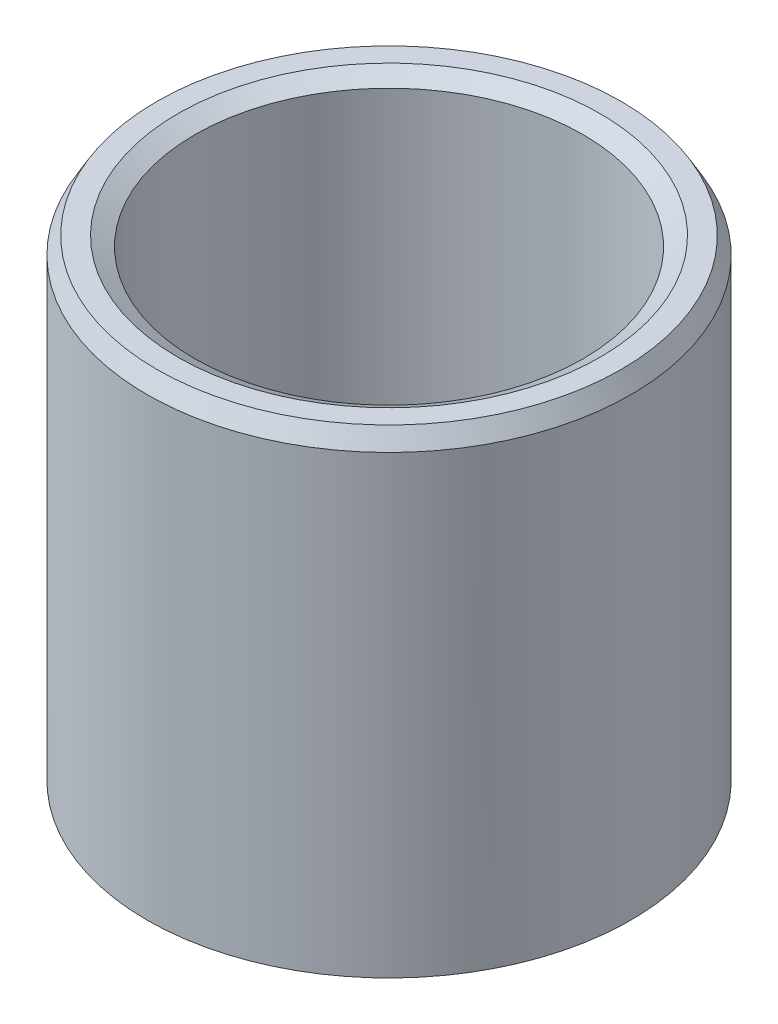
ISO-10303-21;
HEADER;
FILE_DESCRIPTION(('STEP AP214'),'2;1');
FILE_NAME('part.step','',(''),(''),'','','');
FILE_SCHEMA(('AUTOMOTIVE_DESIGN { 1 0 10303 214 1 1 1 1 }'));
ENDSEC;
DATA;
#1=APPLICATION_CONTEXT('core data for automotive mechanical design processes');
#2=APPLICATION_PROTOCOL_DEFINITION('international standard','automotive_design',2000,#1);
#3=PRODUCT_CONTEXT('',#1,'mechanical');
#4=PRODUCT('Part','Part','',(#3));
#5=PRODUCT_RELATED_PRODUCT_CATEGORY('part','',(#4));
#6=PRODUCT_DEFINITION_FORMATION('','',#4);
#7=PRODUCT_DEFINITION_CONTEXT('part definition',#1,'design');
#8=PRODUCT_DEFINITION('design','',#6,#7);
#9=PRODUCT_DEFINITION_SHAPE('','',#8);
#10=(LENGTH_UNIT() NAMED_UNIT(*) SI_UNIT(.MILLI.,.METRE.));
#11=(NAMED_UNIT(*) PLANE_ANGLE_UNIT() SI_UNIT($,.RADIAN.));
#12=(NAMED_UNIT(*) SI_UNIT($,.STERADIAN.) SOLID_ANGLE_UNIT());
#13=UNCERTAINTY_MEASURE_WITH_UNIT(LENGTH_MEASURE(1.E-05),#10,'distance_accuracy_value','');
#14=(GEOMETRIC_REPRESENTATION_CONTEXT(3) GLOBAL_UNCERTAINTY_ASSIGNED_CONTEXT((#13)) GLOBAL_UNIT_ASSIGNED_CONTEXT((#10,
#11,#12)) REPRESENTATION_CONTEXT('',''));
#15=CARTESIAN_POINT('',(0.,0.,0.));
#16=DIRECTION('',(0.,0.,1.));
#17=DIRECTION('',(1.,0.,0.));
#18=AXIS2_PLACEMENT_3D('',#15,#16,#17);
#19=CARTESIAN_POINT('',(0.,104.554395297493,0.));
#20=DIRECTION('',(0.,-1.,0.));
#21=DIRECTION('',(0.,0.,-1.));
#22=AXIS2_PLACEMENT_3D('',#19,#20,#21);
#23=CYLINDRICAL_SURFACE('',#22,52.5);
#24=CARTESIAN_POINT('',(0.,2.12049224024727,0.));
#25=DIRECTION('',(0.,1.,0.));
#26=DIRECTION('',(0.,0.,1.));
#27=AXIS2_PLACEMENT_3D('',#24,#25,#26);
#28=CIRCLE('',#27,52.5);
#29=CARTESIAN_POINT('',(0.,2.12049224024725,-52.5));
#30=VERTEX_POINT('',#29);
#31=EDGE_CURVE('E10',#30,#30,#28,.T.);
#32=CARTESIAN_POINT('',(0.,100.881595000329,0.));
#33=DIRECTION('',(0.,1.,0.));
#34=DIRECTION('',(0.,0.,1.));
#35=AXIS2_PLACEMENT_3D('',#32,#33,#34);
#36=CIRCLE('',#35,52.5);
#37=CARTESIAN_POINT('',(0.,100.881595000329,-52.5));
#38=VERTEX_POINT('',#37);
#39=EDGE_CURVE('E50',#38,#38,#36,.F.);
#40=CARTESIAN_POINT('',(0.,2.12049224024725,-52.5));
#41=CARTESIAN_POINT('',(0.,3.14925372733144,-52.5));
#42=CARTESIAN_POINT('',(0.,4.17801521441563,-52.5));
#43=CARTESIAN_POINT('',(0.,6.235538188584,-52.5));
#44=CARTESIAN_POINT('',(0.,7.26429967566819,-52.5));
#45=CARTESIAN_POINT('',(0.,9.32182264983656,-52.5));
#46=CARTESIAN_POINT('',(0.,10.3505841369208,-52.5));
#47=CARTESIAN_POINT('',(0.,12.4081071110891,-52.5));
#48=CARTESIAN_POINT('',(0.,13.4368685981733,-52.5));
#49=CARTESIAN_POINT('',(0.,15.4943915723417,-52.5));
#50=CARTESIAN_POINT('',(0.,16.5231530594259,-52.5));
#51=CARTESIAN_POINT('',(0.,18.5806760335943,-52.5));
#52=CARTESIAN_POINT('',(0.,19.6094375206784,-52.5));
#53=CARTESIAN_POINT('',(0.,21.6669604948468,-52.5));
#54=CARTESIAN_POINT('',(0.,22.695721981931,-52.5));
#55=CARTESIAN_POINT('',(0.,24.7532449560994,-52.5));
#56=CARTESIAN_POINT('',(0.,25.7820064431836,-52.5));
#57=CARTESIAN_POINT('',(0.,27.8395294173519,-52.5));
#58=CARTESIAN_POINT('',(0.,28.8682909044361,-52.5));
#59=CARTESIAN_POINT('',(0.,30.9258138786045,-52.5));
#60=CARTESIAN_POINT('',(0.,31.9545753656887,-52.5));
#61=CARTESIAN_POINT('',(0.,34.0120983398571,-52.5));
#62=CARTESIAN_POINT('',(0.,35.0408598269413,-52.5));
#63=CARTESIAN_POINT('',(0.,37.0983828011096,-52.5));
#64=CARTESIAN_POINT('',(0.,38.1271442881938,-52.5));
#65=CARTESIAN_POINT('',(0.,40.1846672623622,-52.5));
#66=CARTESIAN_POINT('',(0.,41.2134287494464,-52.5));
#67=CARTESIAN_POINT('',(0.,43.2709517236147,-52.5));
#68=CARTESIAN_POINT('',(0.,44.2997132106989,-52.5));
#69=CARTESIAN_POINT('',(0.,46.3572361848673,-52.5));
#70=CARTESIAN_POINT('',(0.,47.3859976719515,-52.5));
#71=CARTESIAN_POINT('',(0.,49.4435206461199,-52.5));
#72=CARTESIAN_POINT('',(0.,50.4722821332041,-52.5));
#73=CARTESIAN_POINT('',(0.,52.5298051073724,-52.5));
#74=CARTESIAN_POINT('',(0.,53.5585665944566,-52.5));
#75=CARTESIAN_POINT('',(0.,55.616089568625,-52.5));
#76=CARTESIAN_POINT('',(0.,56.6448510557092,-52.5));
#77=CARTESIAN_POINT('',(0.,58.7023740298776,-52.5));
#78=CARTESIAN_POINT('',(0.,59.7311355169617,-52.5));
#79=CARTESIAN_POINT('',(0.,61.7886584911301,-52.5));
#80=CARTESIAN_POINT('',(0.,62.8174199782143,-52.5));
#81=CARTESIAN_POINT('',(0.,64.8749429523827,-52.5));
#82=CARTESIAN_POINT('',(0.,65.9037044394669,-52.5));
#83=CARTESIAN_POINT('',(0.,67.9612274136352,-52.5));
#84=CARTESIAN_POINT('',(0.,68.9899889007194,-52.5));
#85=CARTESIAN_POINT('',(0.,71.0475118748878,-52.5));
#86=CARTESIAN_POINT('',(0.,72.076273361972,-52.5));
#87=CARTESIAN_POINT('',(0.,74.1337963361403,-52.5));
#88=CARTESIAN_POINT('',(0.,75.1625578232245,-52.5));
#89=CARTESIAN_POINT('',(0.,77.2200807973929,-52.5));
#90=CARTESIAN_POINT('',(0.,78.2488422844771,-52.5));
#91=CARTESIAN_POINT('',(0.,80.3063652586455,-52.5));
#92=CARTESIAN_POINT('',(0.,81.3351267457297,-52.5));
#93=CARTESIAN_POINT('',(0.,83.392649719898,-52.5));
#94=CARTESIAN_POINT('',(0.,84.4214112069822,-52.5));
#95=CARTESIAN_POINT('',(0.,86.4789341811506,-52.5));
#96=CARTESIAN_POINT('',(0.,87.5076956682348,-52.5));
#97=CARTESIAN_POINT('',(0.,89.5652186424032,-52.5));
#98=CARTESIAN_POINT('',(0.,90.5939801294873,-52.5));
#99=CARTESIAN_POINT('',(0.,92.6515031036557,-52.5));
#100=CARTESIAN_POINT('',(0.,93.6802645907399,-52.5));
#101=CARTESIAN_POINT('',(0.,95.7377875649083,-52.5));
#102=CARTESIAN_POINT('',(0.,96.7665490519925,-52.5));
#103=CARTESIAN_POINT('',(0.,98.8240720261608,-52.5));
#104=CARTESIAN_POINT('',(0.,99.852833513245,-52.5));
#105=CARTESIAN_POINT('',(0.,100.881595000329,-52.5));
#106=B_SPLINE_CURVE_WITH_KNOTS('',3,(#40,#41,#42,#43,#44,#45,#46,#47,#48,#49,#50,#51,#52,#53,
#54,#55,#56,#57,#58,#59,#60,#61,#62,#63,#64,#65,#66,#67,#68,#69,#70,#71,#72,#73,#74,#75,#76,#77,
#78,#79,#80,#81,#82,#83,#84,#85,#86,#87,#88,#89,#90,#91,#92,#93,#94,#95,#96,#97,#98,#99,#100,
#101,#102,#103,#104,#105),.UNSPECIFIED.,.F.,.F.,(4,2,2,2,2,2,2,2,2,2,2,2,2,2,2,2,2,2,2,2,2,2,2,
2,2,2,2,2,2,2,2,2,4),(0.,3.08628446125256,6.17256892250512,9.25885338375769,12.3451378450102,
15.4314223062628,18.5177067675154,21.6039912287679,24.6902756900205,27.7765601512731,
30.8628446125256,33.9491290737782,37.0354135350307,40.1216979962833,43.2079824575359,
46.2942669187884,49.380551380041,52.4668358412935,55.5531203025461,58.6394047637987,
61.7256892250512,64.8119736863038,67.8982581475564,70.9845426088089,74.0708270700615,
77.157111531314,80.2433959925666,83.3296804538192,86.4159649150717,89.5022493763243,
92.5885338375769,95.6748182988294,98.761102760082),.UNSPECIFIED.);
#107=EDGE_CURVE('BSEAM39',#30,#38,#106,.T.);
#108=ORIENTED_EDGE('',*,*,#31,.T.);
#109=ORIENTED_EDGE('',*,*,#39,.T.);
#110=ORIENTED_EDGE('',*,*,#107,.T.);
#111=ORIENTED_EDGE('',*,*,#107,.F.);
#112=EDGE_LOOP('',(#108,#110,#109,#111));
#113=FACE_BOUND('',#112,.T.);
#114=ADVANCED_FACE('F39',(#113),#23,.T.);
#115=CARTESIAN_POINT('',(0.,104.554395297493,0.));
#116=DIRECTION('',(0.,1.,0.));
#117=DIRECTION('',(0.,0.,1.));
#118=AXIS2_PLACEMENT_3D('',#115,#116,#117);
#119=PLANE('',#118);
#120=CARTESIAN_POINT('',(0.,104.554395297493,0.));
#121=DIRECTION('',(0.,1.,0.));
#122=DIRECTION('',(0.,0.,1.));
#123=AXIS2_PLACEMENT_3D('',#120,#121,#122);
#124=CIRCLE('',#123,45.8037588209471);
#125=CARTESIAN_POINT('',(0.,104.554395297493,45.8037588209471));
#126=VERTEX_POINT('',#125);
#127=EDGE_CURVE('E58',#126,#126,#124,.F.);
#128=ORIENTED_EDGE('',*,*,#127,.T.);
#129=EDGE_LOOP('',(#128));
#130=FACE_BOUND('',#129,.T.);
#131=CARTESIAN_POINT('',(0.,104.554395297493,0.));
#132=DIRECTION('',(0.,1.,0.));
#133=DIRECTION('',(0.,0.,1.));
#134=AXIS2_PLACEMENT_3D('',#131,#132,#133);
#135=CIRCLE('',#134,50.3795077597529);
#136=CARTESIAN_POINT('',(0.,104.554395297493,50.3795077597529));
#137=VERTEX_POINT('',#136);
#138=EDGE_CURVE('E61',#137,#137,#135,.T.);
#139=ORIENTED_EDGE('',*,*,#138,.T.);
#140=EDGE_LOOP('',(#139));
#141=FACE_BOUND('',#140,.T.);
#142=ADVANCED_FACE('F88',(#130,#141),#119,.T.);
#143=CARTESIAN_POINT('',(0.,0.,0.));
#144=DIRECTION('',(0.,1.,0.));
#145=DIRECTION('',(0.,0.,1.));
#146=AXIS2_PLACEMENT_3D('',#143,#144,#145);
#147=PLANE('',#146);
#148=CARTESIAN_POINT('',(0.,0.,0.));
#149=DIRECTION('',(0.,1.,0.));
#150=DIRECTION('',(0.,0.,1.));
#151=AXIS2_PLACEMENT_3D('',#148,#149,#150);
#152=CIRCLE('',#151,44.2514507640304);
#153=CARTESIAN_POINT('',(0.,0.,44.2514507640304));
#154=VERTEX_POINT('',#153);
#155=EDGE_CURVE('E51',#154,#154,#152,.T.);
#156=ORIENTED_EDGE('',*,*,#155,.T.);
#157=EDGE_LOOP('',(#156));
#158=FACE_BOUND('',#157,.T.);
#159=CARTESIAN_POINT('',(0.,0.,0.));
#160=DIRECTION('',(0.,1.,0.));
#161=DIRECTION('',(0.,0.,1.));
#162=AXIS2_PLACEMENT_3D('',#159,#160,#161);
#163=CIRCLE('',#162,48.8271997028362);
#164=CARTESIAN_POINT('',(0.,0.,48.8271997028362));
#165=VERTEX_POINT('',#164);
#166=EDGE_CURVE('E54',#165,#165,#163,.F.);
#167=ORIENTED_EDGE('',*,*,#166,.T.);
#168=EDGE_LOOP('',(#167));
#169=FACE_BOUND('',#168,.T.);
#170=ADVANCED_FACE('F83',(#158,#169),#147,.F.);
#171=CARTESIAN_POINT('',(0.,104.554395297493,0.));
#172=DIRECTION('',(0.,-1.,0.));
#173=DIRECTION('',(0.,0.,-1.));
#174=AXIS2_PLACEMENT_3D('',#171,#172,#173);
#175=CYLINDRICAL_SURFACE('',#174,42.1309585237832);
#176=CARTESIAN_POINT('',(0.,102.433903057246,0.));
#177=DIRECTION('',(0.,1.,0.));
#178=DIRECTION('',(0.,0.,1.));
#179=AXIS2_PLACEMENT_3D('',#176,#177,#178);
#180=CIRCLE('',#179,42.1309585237832);
#181=CARTESIAN_POINT('',(0.,102.433903057246,-42.1309585237832));
#182=VERTEX_POINT('',#181);
#183=EDGE_CURVE('E67',#182,#182,#180,.T.);
#184=CARTESIAN_POINT('',(0.,3.67280029716376,0.));
#185=DIRECTION('',(0.,1.,0.));
#186=DIRECTION('',(0.,0.,1.));
#187=AXIS2_PLACEMENT_3D('',#184,#185,#186);
#188=CIRCLE('',#187,42.1309585237832);
#189=CARTESIAN_POINT('',(0.,3.67280029716376,-42.1309585237832));
#190=VERTEX_POINT('',#189);
#191=EDGE_CURVE('E69',#190,#190,#188,.F.);
#192=CARTESIAN_POINT('',(0.,102.433903057246,-42.1309585237832));
#193=CARTESIAN_POINT('',(0.,101.405141570161,-42.1309585237832));
#194=CARTESIAN_POINT('',(0.,100.376380083077,-42.1309585237832));
#195=CARTESIAN_POINT('',(0.,98.3188571089089,-42.1309585237832));
#196=CARTESIAN_POINT('',(0.,97.2900956218247,-42.1309585237832));
#197=CARTESIAN_POINT('',(0.,95.2325726476563,-42.1309585237832));
#198=CARTESIAN_POINT('',(0.,94.2038111605721,-42.1309585237832));
#199=CARTESIAN_POINT('',(0.,92.1462881864038,-42.1309585237832));
#200=CARTESIAN_POINT('',(0.,91.1175266993196,-42.1309585237832));
#201=CARTESIAN_POINT('',(0.,89.0600037251512,-42.1309585237832));
#202=CARTESIAN_POINT('',(0.,88.031242238067,-42.1309585237832));
#203=CARTESIAN_POINT('',(0.,85.9737192638987,-42.1309585237832));
#204=CARTESIAN_POINT('',(0.,84.9449577768145,-42.1309585237832));
#205=CARTESIAN_POINT('',(0.,82.8874348026461,-42.1309585237832));
#206=CARTESIAN_POINT('',(0.,81.8586733155619,-42.1309585237832));
#207=CARTESIAN_POINT('',(0.,79.8011503413935,-42.1309585237832));
#208=CARTESIAN_POINT('',(0.,78.7723888543093,-42.1309585237832));
#209=CARTESIAN_POINT('',(0.,76.714865880141,-42.1309585237832));
#210=CARTESIAN_POINT('',(0.,75.6861043930568,-42.1309585237832));
#211=CARTESIAN_POINT('',(0.,73.6285814188884,-42.1309585237832));
#212=CARTESIAN_POINT('',(0.,72.5998199318042,-42.1309585237832));
#213=CARTESIAN_POINT('',(0.,70.5422969576359,-42.1309585237832));
#214=CARTESIAN_POINT('',(0.,69.5135354705517,-42.1309585237832));
#215=CARTESIAN_POINT('',(0.,67.4560124963833,-42.1309585237832));
#216=CARTESIAN_POINT('',(0.,66.4272510092991,-42.1309585237832));
#217=CARTESIAN_POINT('',(0.,64.3697280351307,-42.1309585237832));
#218=CARTESIAN_POINT('',(0.,63.3409665480466,-42.1309585237832));
#219=CARTESIAN_POINT('',(0.,61.2834435738782,-42.1309585237832));
#220=CARTESIAN_POINT('',(0.,60.254682086794,-42.1309585237832));
#221=CARTESIAN_POINT('',(0.,58.1971591126256,-42.1309585237832));
#222=CARTESIAN_POINT('',(0.,57.1683976255414,-42.1309585237832));
#223=CARTESIAN_POINT('',(0.,55.1108746513731,-42.1309585237832));
#224=CARTESIAN_POINT('',(0.,54.0821131642889,-42.1309585237832));
#225=CARTESIAN_POINT('',(0.,52.0245901901205,-42.1309585237832));
#226=CARTESIAN_POINT('',(0.,50.9958287030363,-42.1309585237832));
#227=CARTESIAN_POINT('',(0.,48.9383057288679,-42.1309585237832));
#228=CARTESIAN_POINT('',(0.,47.9095442417838,-42.1309585237832));
#229=CARTESIAN_POINT('',(0.,45.8520212676154,-42.1309585237832));
#230=CARTESIAN_POINT('',(0.,44.8232597805312,-42.1309585237832));
#231=CARTESIAN_POINT('',(0.,42.7657368063628,-42.1309585237832));
#232=CARTESIAN_POINT('',(0.,41.7369753192786,-42.1309585237832));
#233=CARTESIAN_POINT('',(0.,39.6794523451103,-42.1309585237832));
#234=CARTESIAN_POINT('',(0.,38.6506908580261,-42.1309585237832));
#235=CARTESIAN_POINT('',(0.,36.5931678838577,-42.1309585237832));
#236=CARTESIAN_POINT('',(0.,35.5644063967735,-42.1309585237832));
#237=CARTESIAN_POINT('',(0.,33.5068834226052,-42.1309585237832));
#238=CARTESIAN_POINT('',(0.,32.478121935521,-42.1309585237832));
#239=CARTESIAN_POINT('',(0.,30.4205989613526,-42.1309585237832));
#240=CARTESIAN_POINT('',(0.,29.3918374742684,-42.1309585237832));
#241=CARTESIAN_POINT('',(0.,27.3343145001,-42.1309585237832));
#242=CARTESIAN_POINT('',(0.,26.3055530130158,-42.1309585237832));
#243=CARTESIAN_POINT('',(0.,24.2480300388475,-42.1309585237832));
#244=CARTESIAN_POINT('',(0.,23.2192685517633,-42.1309585237832));
#245=CARTESIAN_POINT('',(0.,21.1617455775949,-42.1309585237832));
#246=CARTESIAN_POINT('',(0.,20.1329840905107,-42.1309585237832));
#247=CARTESIAN_POINT('',(0.,18.0754611163424,-42.1309585237832));
#248=CARTESIAN_POINT('',(0.,17.0466996292582,-42.1309585237832));
#249=CARTESIAN_POINT('',(0.,14.9891766550898,-42.1309585237832));
#250=CARTESIAN_POINT('',(0.,13.9604151680056,-42.1309585237832));
#251=CARTESIAN_POINT('',(0.,11.9028921938372,-42.1309585237832));
#252=CARTESIAN_POINT('',(0.,10.8741307067531,-42.1309585237832));
#253=CARTESIAN_POINT('',(0.,8.81660773258469,-42.1309585237832));
#254=CARTESIAN_POINT('',(0.,7.7878462455005,-42.1309585237832));
#255=CARTESIAN_POINT('',(0.,5.73032327133213,-42.1309585237832));
#256=CARTESIAN_POINT('',(0.,4.70156178424794,-42.1309585237832));
#257=CARTESIAN_POINT('',(0.,3.67280029716376,-42.1309585237832));
#258=B_SPLINE_CURVE_WITH_KNOTS('',3,(#192,#193,#194,#195,#196,#197,#198,#199,#200,#201,#202,
#203,#204,#205,#206,#207,#208,#209,#210,#211,#212,#213,#214,#215,#216,#217,#218,#219,#220,#221,
#222,#223,#224,#225,#226,#227,#228,#229,#230,#231,#232,#233,#234,#235,#236,#237,#238,#239,#240,
#241,#242,#243,#244,#245,#246,#247,#248,#249,#250,#251,#252,#253,#254,#255,#256,#257),
.UNSPECIFIED.,.F.,.F.,(4,2,2,2,2,2,2,2,2,2,2,2,2,2,2,2,2,2,2,2,2,2,2,2,2,2,2,2,2,2,2,2,4),(0.,
3.08628446125256,6.17256892250512,9.25885338375768,12.3451378450102,15.4314223062628,
18.5177067675154,21.6039912287679,24.6902756900205,27.776560151273,30.8628446125256,
33.9491290737781,37.0354135350307,40.1216979962833,43.2079824575358,46.2942669187884,
49.3805513800409,52.4668358412935,55.5531203025461,58.6394047637986,61.7256892250512,
64.8119736863037,67.8982581475563,70.9845426088089,74.0708270700614,77.157111531314,
80.2433959925665,83.3296804538191,86.4159649150716,89.5022493763242,92.5885338375768,
95.6748182988293,98.7611027600819),.UNSPECIFIED.);
#259=EDGE_CURVE('BSEAM71',#182,#190,#258,.T.);
#260=ORIENTED_EDGE('',*,*,#183,.T.);
#261=ORIENTED_EDGE('',*,*,#191,.T.);
#262=ORIENTED_EDGE('',*,*,#259,.T.);
#263=ORIENTED_EDGE('',*,*,#259,.F.);
#264=EDGE_LOOP('',(#260,#262,#261,#263));
#265=FACE_BOUND('',#264,.T.);
#266=ADVANCED_FACE('F71',(#265),#175,.F.);
#267=CARTESIAN_POINT('',(0.,102.433903057246,0.));
#268=DIRECTION('',(0.,1.,0.));
#269=DIRECTION('',(0.,0.,1.));
#270=AXIS2_PLACEMENT_3D('',#267,#268,#269);
#271=CONICAL_SURFACE('',#270,42.1309585237832,1.0471975511966);
#272=ORIENTED_EDGE('',*,*,#127,.F.);
#273=EDGE_LOOP('',(#272));
#274=FACE_BOUND('',#273,.T.);
#275=ORIENTED_EDGE('',*,*,#183,.F.);
#276=EDGE_LOOP('',(#275));
#277=FACE_BOUND('',#276,.T.);
#278=ADVANCED_FACE('F77',(#274,#277),#271,.F.);
#279=CARTESIAN_POINT('',(0.,0.,0.));
#280=DIRECTION('',(0.,-1.,0.));
#281=DIRECTION('',(0.,0.,-1.));
#282=AXIS2_PLACEMENT_3D('',#279,#280,#281);
#283=CONICAL_SURFACE('',#282,44.2514507640304,0.523598775598298);
#284=ORIENTED_EDGE('',*,*,#191,.F.);
#285=EDGE_LOOP('',(#284));
#286=FACE_BOUND('',#285,.T.);
#287=ORIENTED_EDGE('',*,*,#155,.F.);
#288=EDGE_LOOP('',(#287));
#289=FACE_BOUND('',#288,.T.);
#290=ADVANCED_FACE('F73',(#286,#289),#283,.F.);
#291=CARTESIAN_POINT('',(0.,2.12049224024727,0.));
#292=DIRECTION('',(0.,1.,0.));
#293=DIRECTION('',(0.,0.,1.));
#294=AXIS2_PLACEMENT_3D('',#291,#292,#293);
#295=CONICAL_SURFACE('',#294,52.5,1.0471975511966);
#296=ORIENTED_EDGE('',*,*,#166,.F.);
#297=EDGE_LOOP('',(#296));
#298=FACE_BOUND('',#297,.T.);
#299=ORIENTED_EDGE('',*,*,#31,.F.);
#300=EDGE_LOOP('',(#299));
#301=FACE_BOUND('',#300,.T.);
#302=ADVANCED_FACE('F76',(#298,#301),#295,.T.);
#303=CARTESIAN_POINT('',(0.,104.554395297493,0.));
#304=DIRECTION('',(0.,-1.,0.));
#305=DIRECTION('',(0.,0.,-1.));
#306=AXIS2_PLACEMENT_3D('',#303,#304,#305);
#307=CONICAL_SURFACE('',#306,50.3795077597529,0.523598775598294);
#308=ORIENTED_EDGE('',*,*,#39,.F.);
#309=EDGE_LOOP('',(#308));
#310=FACE_BOUND('',#309,.T.);
#311=ORIENTED_EDGE('',*,*,#138,.F.);
#312=EDGE_LOOP('',(#311));
#313=FACE_BOUND('',#312,.T.);
#314=ADVANCED_FACE('F45',(#310,#313),#307,.T.);
#315=CLOSED_SHELL('',(#114,#142,#170,#266,#278,#290,#302,#314));
#316=MANIFOLD_SOLID_BREP('B2',#315);
#317=ADVANCED_BREP_SHAPE_REPRESENTATION('',(#18,#316),#14);
#318=SHAPE_DEFINITION_REPRESENTATION(#9,#317);
ENDSEC;
END-ISO-10303-21;
